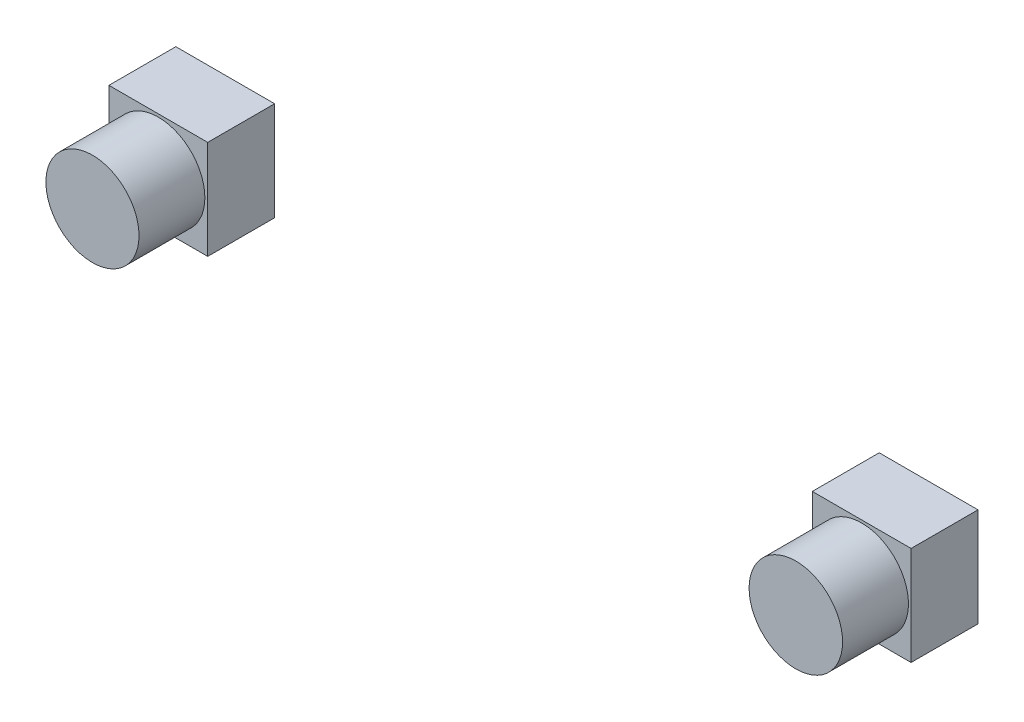
ISO-10303-21;
HEADER;
FILE_DESCRIPTION(('STEP AP214'),'2;1');
FILE_NAME('part.step','',(''),(''),'','','');
FILE_SCHEMA(('AUTOMOTIVE_DESIGN { 1 0 10303 214 1 1 1 1 }'));
ENDSEC;
DATA;
#1=APPLICATION_CONTEXT('core data for automotive mechanical design processes');
#2=APPLICATION_PROTOCOL_DEFINITION('international standard','automotive_design',2000,#1);
#3=PRODUCT_CONTEXT('',#1,'mechanical');
#4=PRODUCT('Part','Part','',(#3));
#5=PRODUCT_RELATED_PRODUCT_CATEGORY('part','',(#4));
#6=PRODUCT_DEFINITION_FORMATION('','',#4);
#7=PRODUCT_DEFINITION_CONTEXT('part definition',#1,'design');
#8=PRODUCT_DEFINITION('design','',#6,#7);
#9=PRODUCT_DEFINITION_SHAPE('','',#8);
#10=(LENGTH_UNIT() NAMED_UNIT(*) SI_UNIT(.MILLI.,.METRE.));
#11=(NAMED_UNIT(*) PLANE_ANGLE_UNIT() SI_UNIT($,.RADIAN.));
#12=(NAMED_UNIT(*) SI_UNIT($,.STERADIAN.) SOLID_ANGLE_UNIT());
#13=UNCERTAINTY_MEASURE_WITH_UNIT(LENGTH_MEASURE(1.E-05),#10,'distance_accuracy_value','');
#14=(GEOMETRIC_REPRESENTATION_CONTEXT(3) GLOBAL_UNCERTAINTY_ASSIGNED_CONTEXT((#13)) GLOBAL_UNIT_ASSIGNED_CONTEXT((#10,
#11,#12)) REPRESENTATION_CONTEXT('',''));
#15=CARTESIAN_POINT('',(0.,0.,0.));
#16=DIRECTION('',(0.,0.,1.));
#17=DIRECTION('',(1.,0.,0.));
#18=AXIS2_PLACEMENT_3D('',#15,#16,#17);
#19=CARTESIAN_POINT('',(-304.,635.27,50.8));
#20=DIRECTION('',(0.,0.,1.));
#21=DIRECTION('',(1.,0.,0.));
#22=AXIS2_PLACEMENT_3D('',#19,#20,#21);
#23=PLANE('',#22);
#24=DIRECTION('',(0.,-1.,0.));
#25=VECTOR('',#24,1.);
#26=CARTESIAN_POINT('',(-304.,710.27,50.8));
#27=LINE('',#26,#25);
#28=CARTESIAN_POINT('',(-304.,710.27,50.8));
#29=VERTEX_POINT('',#28);
#30=CARTESIAN_POINT('',(-304.,635.27,50.8));
#31=VERTEX_POINT('',#30);
#32=EDGE_CURVE('E95',#29,#31,#27,.T.);
#33=ORIENTED_EDGE('',*,*,#32,.T.);
#34=DIRECTION('',(1.,0.,0.));
#35=VECTOR('',#34,1.);
#36=CARTESIAN_POINT('',(-304.,635.27,50.8));
#37=LINE('',#36,#35);
#38=CARTESIAN_POINT('',(-229.,635.27,50.8));
#39=VERTEX_POINT('',#38);
#40=EDGE_CURVE('E90',#31,#39,#37,.T.);
#41=ORIENTED_EDGE('',*,*,#40,.T.);
#42=DIRECTION('',(0.,1.,0.));
#43=VECTOR('',#42,1.);
#44=CARTESIAN_POINT('',(-229.,710.27,50.8));
#45=LINE('',#44,#43);
#46=CARTESIAN_POINT('',(-229.,710.27,50.8));
#47=VERTEX_POINT('',#46);
#48=EDGE_CURVE('E93',#39,#47,#45,.T.);
#49=ORIENTED_EDGE('',*,*,#48,.T.);
#50=DIRECTION('',(-1.,0.,0.));
#51=VECTOR('',#50,1.);
#52=CARTESIAN_POINT('',(-304.,710.27,50.8));
#53=LINE('',#52,#51);
#54=EDGE_CURVE('E60',#47,#29,#53,.T.);
#55=ORIENTED_EDGE('',*,*,#54,.T.);
#56=EDGE_LOOP('',(#33,#41,#49,#55));
#57=FACE_BOUND('',#56,.T.);
#58=CARTESIAN_POINT('',(-266.5,672.77,50.8));
#59=DIRECTION('',(0.,0.,1.));
#60=DIRECTION('',(1.,0.,0.));
#61=AXIS2_PLACEMENT_3D('',#58,#59,#60);
#62=CIRCLE('',#61,35.3413521450281);
#63=CARTESIAN_POINT('',(-231.158647854972,672.77,50.8));
#64=VERTEX_POINT('',#63);
#65=EDGE_CURVE('E121',#64,#64,#62,.T.);
#66=ORIENTED_EDGE('',*,*,#65,.F.);
#67=EDGE_LOOP('',(#66));
#68=FACE_BOUND('',#67,.T.);
#69=ADVANCED_FACE('F43',(#57,#68),#23,.T.);
#70=CARTESIAN_POINT('',(-304.,710.27,50.8));
#71=DIRECTION('',(1.,0.,0.));
#72=DIRECTION('',(0.,0.,-1.));
#73=AXIS2_PLACEMENT_3D('',#70,#71,#72);
#74=PLANE('',#73);
#75=DIRECTION('',(0.,-1.,0.));
#76=VECTOR('',#75,1.);
#77=CARTESIAN_POINT('',(-304.,710.27,0.));
#78=LINE('',#77,#76);
#79=CARTESIAN_POINT('',(-304.,710.27,0.));
#80=VERTEX_POINT('',#79);
#81=CARTESIAN_POINT('',(-304.,635.27,0.));
#82=VERTEX_POINT('',#81);
#83=EDGE_CURVE('E107',#80,#82,#78,.T.);
#84=ORIENTED_EDGE('',*,*,#83,.T.);
#85=DIRECTION('',(0.,0.,-1.));
#86=VECTOR('',#85,1.);
#87=CARTESIAN_POINT('',(-304.,635.27,50.8));
#88=LINE('',#87,#86);
#89=EDGE_CURVE('E12',#31,#82,#88,.T.);
#90=ORIENTED_EDGE('',*,*,#89,.F.);
#91=ORIENTED_EDGE('',*,*,#32,.F.);
#92=DIRECTION('',(0.,0.,-1.));
#93=VECTOR('',#92,1.);
#94=CARTESIAN_POINT('',(-304.,710.27,50.8));
#95=LINE('',#94,#93);
#96=EDGE_CURVE('E103',#29,#80,#95,.T.);
#97=ORIENTED_EDGE('',*,*,#96,.T.);
#98=EDGE_LOOP('',(#84,#90,#91,#97));
#99=FACE_BOUND('',#98,.T.);
#100=ADVANCED_FACE('F45',(#99),#74,.F.);
#101=CARTESIAN_POINT('',(-304.,635.27,50.8));
#102=DIRECTION('',(0.,1.,0.));
#103=DIRECTION('',(0.,0.,1.));
#104=AXIS2_PLACEMENT_3D('',#101,#102,#103);
#105=PLANE('',#104);
#106=DIRECTION('',(1.,0.,0.));
#107=VECTOR('',#106,1.);
#108=CARTESIAN_POINT('',(-304.,635.27,0.));
#109=LINE('',#108,#107);
#110=CARTESIAN_POINT('',(-229.,635.27,0.));
#111=VERTEX_POINT('',#110);
#112=EDGE_CURVE('E99',#82,#111,#109,.T.);
#113=ORIENTED_EDGE('',*,*,#112,.T.);
#114=DIRECTION('',(0.,0.,-1.));
#115=VECTOR('',#114,1.);
#116=CARTESIAN_POINT('',(-229.,635.27,50.8));
#117=LINE('',#116,#115);
#118=EDGE_CURVE('E52',#39,#111,#117,.T.);
#119=ORIENTED_EDGE('',*,*,#118,.F.);
#120=ORIENTED_EDGE('',*,*,#40,.F.);
#121=ORIENTED_EDGE('',*,*,#89,.T.);
#122=EDGE_LOOP('',(#113,#119,#120,#121));
#123=FACE_BOUND('',#122,.T.);
#124=ADVANCED_FACE('F98',(#123),#105,.F.);
#125=CARTESIAN_POINT('',(-229.,710.27,50.8));
#126=DIRECTION('',(-1.,0.,0.));
#127=DIRECTION('',(0.,0.,1.));
#128=AXIS2_PLACEMENT_3D('',#125,#126,#127);
#129=PLANE('',#128);
#130=DIRECTION('',(0.,1.,0.));
#131=VECTOR('',#130,1.);
#132=CARTESIAN_POINT('',(-229.,710.27,0.));
#133=LINE('',#132,#131);
#134=CARTESIAN_POINT('',(-229.,710.27,0.));
#135=VERTEX_POINT('',#134);
#136=EDGE_CURVE('E77',#111,#135,#133,.T.);
#137=ORIENTED_EDGE('',*,*,#136,.T.);
#138=DIRECTION('',(0.,0.,-1.));
#139=VECTOR('',#138,1.);
#140=CARTESIAN_POINT('',(-229.,710.27,50.8));
#141=LINE('',#140,#139);
#142=EDGE_CURVE('E100',#47,#135,#141,.T.);
#143=ORIENTED_EDGE('',*,*,#142,.F.);
#144=ORIENTED_EDGE('',*,*,#48,.F.);
#145=ORIENTED_EDGE('',*,*,#118,.T.);
#146=EDGE_LOOP('',(#137,#143,#144,#145));
#147=FACE_BOUND('',#146,.T.);
#148=ADVANCED_FACE('F101',(#147),#129,.F.);
#149=CARTESIAN_POINT('',(-304.,710.27,50.8));
#150=DIRECTION('',(0.,-1.,0.));
#151=DIRECTION('',(0.,0.,-1.));
#152=AXIS2_PLACEMENT_3D('',#149,#150,#151);
#153=PLANE('',#152);
#154=DIRECTION('',(-1.,0.,0.));
#155=VECTOR('',#154,1.);
#156=CARTESIAN_POINT('',(-304.,710.27,0.));
#157=LINE('',#156,#155);
#158=EDGE_CURVE('E83',#135,#80,#157,.T.);
#159=ORIENTED_EDGE('',*,*,#158,.T.);
#160=ORIENTED_EDGE('',*,*,#96,.F.);
#161=ORIENTED_EDGE('',*,*,#54,.F.);
#162=ORIENTED_EDGE('',*,*,#142,.T.);
#163=EDGE_LOOP('',(#159,#160,#161,#162));
#164=FACE_BOUND('',#163,.T.);
#165=ADVANCED_FACE('F115',(#164),#153,.F.);
#166=CARTESIAN_POINT('',(-304.,635.27,0.));
#167=DIRECTION('',(0.,0.,1.));
#168=DIRECTION('',(1.,0.,0.));
#169=AXIS2_PLACEMENT_3D('',#166,#167,#168);
#170=PLANE('',#169);
#171=ORIENTED_EDGE('',*,*,#83,.F.);
#172=ORIENTED_EDGE('',*,*,#158,.F.);
#173=ORIENTED_EDGE('',*,*,#136,.F.);
#174=ORIENTED_EDGE('',*,*,#112,.F.);
#175=EDGE_LOOP('',(#171,#172,#173,#174));
#176=FACE_BOUND('',#175,.T.);
#177=ADVANCED_FACE('F118',(#176),#170,.F.);
#178=CARTESIAN_POINT('',(-266.5,672.77,100.8));
#179=DIRECTION('',(0.,0.,-1.));
#180=DIRECTION('',(-1.,0.,0.));
#181=AXIS2_PLACEMENT_3D('',#178,#179,#180);
#182=CYLINDRICAL_SURFACE('',#181,35.3413521450281);
#183=CARTESIAN_POINT('',(-266.5,672.77,100.8));
#184=DIRECTION('',(0.,0.,1.));
#185=DIRECTION('',(1.,0.,0.));
#186=AXIS2_PLACEMENT_3D('',#183,#184,#185);
#187=CIRCLE('',#186,35.3413521450281);
#188=CARTESIAN_POINT('',(-231.158647854972,672.77,100.8));
#189=VERTEX_POINT('',#188);
#190=EDGE_CURVE('E110',#189,#189,#187,.T.);
#191=ORIENTED_EDGE('',*,*,#190,.F.);
#192=EDGE_LOOP('',(#191));
#193=FACE_BOUND('',#192,.T.);
#194=ORIENTED_EDGE('',*,*,#65,.T.);
#195=EDGE_LOOP('',(#194));
#196=FACE_BOUND('',#195,.T.);
#197=ADVANCED_FACE('F129',(#193,#196),#182,.T.);
#198=CARTESIAN_POINT('',(-266.5,672.77,100.8));
#199=DIRECTION('',(0.,0.,1.));
#200=DIRECTION('',(1.,0.,0.));
#201=AXIS2_PLACEMENT_3D('',#198,#199,#200);
#202=PLANE('',#201);
#203=ORIENTED_EDGE('',*,*,#190,.T.);
#204=EDGE_LOOP('',(#203));
#205=FACE_BOUND('',#204,.T.);
#206=ADVANCED_FACE('F127',(#205),#202,.T.);
#207=CLOSED_SHELL('',(#69,#100,#124,#148,#165,#177,#197,#206));
#208=MANIFOLD_SOLID_BREP('B2',#207);
#209=CARTESIAN_POINT('',(305.,635.27,50.8));
#210=DIRECTION('',(0.,0.,-1.));
#211=DIRECTION('',(-1.,0.,0.));
#212=AXIS2_PLACEMENT_3D('',#209,#210,#211);
#213=PLANE('',#212);
#214=DIRECTION('',(0.,1.,0.));
#215=VECTOR('',#214,1.);
#216=CARTESIAN_POINT('',(305.,710.27,50.8));
#217=LINE('',#216,#215);
#218=CARTESIAN_POINT('',(305.,635.27,50.8));
#219=VERTEX_POINT('',#218);
#220=CARTESIAN_POINT('',(305.,710.27,50.8));
#221=VERTEX_POINT('',#220);
#222=EDGE_CURVE('E250',#219,#221,#217,.T.);
#223=ORIENTED_EDGE('',*,*,#222,.T.);
#224=DIRECTION('',(-1.,0.,0.));
#225=VECTOR('',#224,1.);
#226=CARTESIAN_POINT('',(305.,710.27,50.8));
#227=LINE('',#226,#225);
#228=CARTESIAN_POINT('',(230.,710.27,50.8));
#229=VERTEX_POINT('',#228);
#230=EDGE_CURVE('E245',#221,#229,#227,.T.);
#231=ORIENTED_EDGE('',*,*,#230,.T.);
#232=DIRECTION('',(0.,-1.,0.));
#233=VECTOR('',#232,1.);
#234=CARTESIAN_POINT('',(230.,710.27,50.8));
#235=LINE('',#234,#233);
#236=CARTESIAN_POINT('',(230.,635.27,50.8));
#237=VERTEX_POINT('',#236);
#238=EDGE_CURVE('E248',#229,#237,#235,.T.);
#239=ORIENTED_EDGE('',*,*,#238,.T.);
#240=DIRECTION('',(1.,0.,0.));
#241=VECTOR('',#240,1.);
#242=CARTESIAN_POINT('',(305.,635.27,50.8));
#243=LINE('',#242,#241);
#244=EDGE_CURVE('E214',#237,#219,#243,.T.);
#245=ORIENTED_EDGE('',*,*,#244,.T.);
#246=EDGE_LOOP('',(#223,#231,#239,#245));
#247=FACE_BOUND('',#246,.T.);
#248=CARTESIAN_POINT('',(267.5,672.77,50.8));
#249=DIRECTION('',(0.,0.,-1.));
#250=DIRECTION('',(-1.,0.,0.));
#251=AXIS2_PLACEMENT_3D('',#248,#249,#250);
#252=CIRCLE('',#251,35.4885946069823);
#253=CARTESIAN_POINT('',(232.011405393018,672.77,50.8));
#254=VERTEX_POINT('',#253);
#255=EDGE_CURVE('E41',#254,#254,#252,.F.);
#256=ORIENTED_EDGE('',*,*,#255,.F.);
#257=EDGE_LOOP('',(#256));
#258=FACE_BOUND('',#257,.T.);
#259=ADVANCED_FACE('F197',(#247,#258),#213,.F.);
#260=CARTESIAN_POINT('',(305.,710.27,50.8));
#261=DIRECTION('',(-1.,0.,0.));
#262=DIRECTION('',(0.,0.,1.));
#263=AXIS2_PLACEMENT_3D('',#260,#261,#262);
#264=PLANE('',#263);
#265=DIRECTION('',(0.,1.,0.));
#266=VECTOR('',#265,1.);
#267=CARTESIAN_POINT('',(305.,710.27,0.));
#268=LINE('',#267,#266);
#269=CARTESIAN_POINT('',(305.,635.27,0.));
#270=VERTEX_POINT('',#269);
#271=CARTESIAN_POINT('',(305.,710.27,0.));
#272=VERTEX_POINT('',#271);
#273=EDGE_CURVE('E264',#270,#272,#268,.T.);
#274=ORIENTED_EDGE('',*,*,#273,.T.);
#275=DIRECTION('',(0.,0.,-1.));
#276=VECTOR('',#275,1.);
#277=CARTESIAN_POINT('',(305.,710.27,50.8));
#278=LINE('',#277,#276);
#279=EDGE_CURVE('E206',#221,#272,#278,.T.);
#280=ORIENTED_EDGE('',*,*,#279,.F.);
#281=ORIENTED_EDGE('',*,*,#222,.F.);
#282=DIRECTION('',(0.,0.,-1.));
#283=VECTOR('',#282,1.);
#284=CARTESIAN_POINT('',(305.,635.27,50.8));
#285=LINE('',#284,#283);
#286=EDGE_CURVE('E260',#219,#270,#285,.T.);
#287=ORIENTED_EDGE('',*,*,#286,.T.);
#288=EDGE_LOOP('',(#274,#280,#281,#287));
#289=FACE_BOUND('',#288,.T.);
#290=ADVANCED_FACE('F199',(#289),#264,.F.);
#291=CARTESIAN_POINT('',(305.,710.27,50.8));
#292=DIRECTION('',(0.,-1.,0.));
#293=DIRECTION('',(0.,0.,-1.));
#294=AXIS2_PLACEMENT_3D('',#291,#292,#293);
#295=PLANE('',#294);
#296=DIRECTION('',(-1.,0.,0.));
#297=VECTOR('',#296,1.);
#298=CARTESIAN_POINT('',(305.,710.27,0.));
#299=LINE('',#298,#297);
#300=CARTESIAN_POINT('',(230.,710.27,0.));
#301=VERTEX_POINT('',#300);
#302=EDGE_CURVE('E255',#272,#301,#299,.T.);
#303=ORIENTED_EDGE('',*,*,#302,.T.);
#304=DIRECTION('',(0.,0.,-1.));
#305=VECTOR('',#304,1.);
#306=CARTESIAN_POINT('',(230.,710.27,50.8));
#307=LINE('',#306,#305);
#308=EDGE_CURVE('E253',#229,#301,#307,.T.);
#309=ORIENTED_EDGE('',*,*,#308,.F.);
#310=ORIENTED_EDGE('',*,*,#230,.F.);
#311=ORIENTED_EDGE('',*,*,#279,.T.);
#312=EDGE_LOOP('',(#303,#309,#310,#311));
#313=FACE_BOUND('',#312,.T.);
#314=ADVANCED_FACE('F254',(#313),#295,.F.);
#315=CARTESIAN_POINT('',(230.,710.27,50.8));
#316=DIRECTION('',(1.,0.,0.));
#317=DIRECTION('',(0.,0.,-1.));
#318=AXIS2_PLACEMENT_3D('',#315,#316,#317);
#319=PLANE('',#318);
#320=DIRECTION('',(0.,-1.,0.));
#321=VECTOR('',#320,1.);
#322=CARTESIAN_POINT('',(230.,710.27,0.));
#323=LINE('',#322,#321);
#324=CARTESIAN_POINT('',(230.,635.27,0.));
#325=VERTEX_POINT('',#324);
#326=EDGE_CURVE('E231',#301,#325,#323,.T.);
#327=ORIENTED_EDGE('',*,*,#326,.T.);
#328=DIRECTION('',(0.,0.,-1.));
#329=VECTOR('',#328,1.);
#330=CARTESIAN_POINT('',(230.,635.27,50.8));
#331=LINE('',#330,#329);
#332=EDGE_CURVE('E256',#237,#325,#331,.T.);
#333=ORIENTED_EDGE('',*,*,#332,.F.);
#334=ORIENTED_EDGE('',*,*,#238,.F.);
#335=ORIENTED_EDGE('',*,*,#308,.T.);
#336=EDGE_LOOP('',(#327,#333,#334,#335));
#337=FACE_BOUND('',#336,.T.);
#338=ADVANCED_FACE('F258',(#337),#319,.F.);
#339=CARTESIAN_POINT('',(305.,635.27,50.8));
#340=DIRECTION('',(0.,1.,0.));
#341=DIRECTION('',(0.,0.,1.));
#342=AXIS2_PLACEMENT_3D('',#339,#340,#341);
#343=PLANE('',#342);
#344=DIRECTION('',(1.,0.,0.));
#345=VECTOR('',#344,1.);
#346=CARTESIAN_POINT('',(305.,635.27,0.));
#347=LINE('',#346,#345);
#348=EDGE_CURVE('E237',#325,#270,#347,.T.);
#349=ORIENTED_EDGE('',*,*,#348,.T.);
#350=ORIENTED_EDGE('',*,*,#286,.F.);
#351=ORIENTED_EDGE('',*,*,#244,.F.);
#352=ORIENTED_EDGE('',*,*,#332,.T.);
#353=EDGE_LOOP('',(#349,#350,#351,#352));
#354=FACE_BOUND('',#353,.T.);
#355=ADVANCED_FACE('F278',(#354),#343,.F.);
#356=CARTESIAN_POINT('',(305.,635.27,0.));
#357=DIRECTION('',(0.,0.,-1.));
#358=DIRECTION('',(-1.,0.,0.));
#359=AXIS2_PLACEMENT_3D('',#356,#357,#358);
#360=PLANE('',#359);
#361=ORIENTED_EDGE('',*,*,#273,.F.);
#362=ORIENTED_EDGE('',*,*,#348,.F.);
#363=ORIENTED_EDGE('',*,*,#326,.F.);
#364=ORIENTED_EDGE('',*,*,#302,.F.);
#365=EDGE_LOOP('',(#361,#362,#363,#364));
#366=FACE_BOUND('',#365,.T.);
#367=ADVANCED_FACE('F275',(#366),#360,.T.);
#368=CARTESIAN_POINT('',(267.5,672.77,100.8));
#369=DIRECTION('',(0.,0.,-1.));
#370=DIRECTION('',(-1.,0.,0.));
#371=AXIS2_PLACEMENT_3D('',#368,#369,#370);
#372=CYLINDRICAL_SURFACE('',#371,35.4885946069823);
#373=CARTESIAN_POINT('',(267.5,672.77,100.8));
#374=DIRECTION('',(0.,0.,1.));
#375=DIRECTION('',(1.,0.,0.));
#376=AXIS2_PLACEMENT_3D('',#373,#374,#375);
#377=CIRCLE('',#376,35.4885946069823);
#378=CARTESIAN_POINT('',(302.988594606982,672.77,100.8));
#379=VERTEX_POINT('',#378);
#380=EDGE_CURVE('E267',#379,#379,#377,.T.);
#381=ORIENTED_EDGE('',*,*,#380,.F.);
#382=EDGE_LOOP('',(#381));
#383=FACE_BOUND('',#382,.T.);
#384=ORIENTED_EDGE('',*,*,#255,.T.);
#385=EDGE_LOOP('',(#384));
#386=FACE_BOUND('',#385,.T.);
#387=ADVANCED_FACE('F277',(#383,#386),#372,.T.);
#388=CARTESIAN_POINT('',(267.5,672.77,100.8));
#389=DIRECTION('',(0.,0.,1.));
#390=DIRECTION('',(1.,0.,0.));
#391=AXIS2_PLACEMENT_3D('',#388,#389,#390);
#392=PLANE('',#391);
#393=ORIENTED_EDGE('',*,*,#380,.T.);
#394=EDGE_LOOP('',(#393));
#395=FACE_BOUND('',#394,.T.);
#396=ADVANCED_FACE('F284',(#395),#392,.T.);
#397=CLOSED_SHELL('',(#259,#290,#314,#338,#355,#367,#387,#396));
#398=MANIFOLD_SOLID_BREP('B6',#397);
#399=ADVANCED_BREP_SHAPE_REPRESENTATION('',(#18,#208,#398),#14);
#400=SHAPE_DEFINITION_REPRESENTATION(#9,#399);
ENDSEC;
END-ISO-10303-21;
